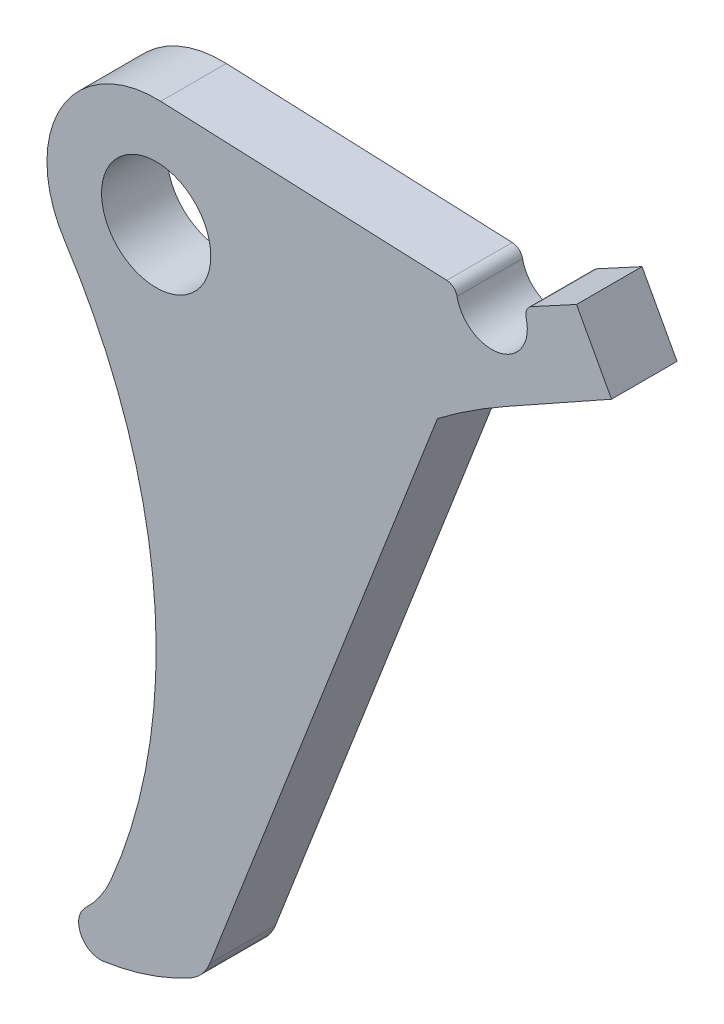
ISO-10303-21;
HEADER;
FILE_DESCRIPTION(('STEP AP214'),'2;1');
FILE_NAME('part.step','',(''),(''),'','','');
FILE_SCHEMA(('AUTOMOTIVE_DESIGN { 1 0 10303 214 1 1 1 1 }'));
ENDSEC;
DATA;
#1=APPLICATION_CONTEXT('core data for automotive mechanical design processes');
#2=APPLICATION_PROTOCOL_DEFINITION('international standard','automotive_design',2000,#1);
#3=PRODUCT_CONTEXT('',#1,'mechanical');
#4=PRODUCT('Part','Part','',(#3));
#5=PRODUCT_RELATED_PRODUCT_CATEGORY('part','',(#4));
#6=PRODUCT_DEFINITION_FORMATION('','',#4);
#7=PRODUCT_DEFINITION_CONTEXT('part definition',#1,'design');
#8=PRODUCT_DEFINITION('design','',#6,#7);
#9=PRODUCT_DEFINITION_SHAPE('','',#8);
#10=(LENGTH_UNIT() NAMED_UNIT(*) SI_UNIT(.MILLI.,.METRE.));
#11=(NAMED_UNIT(*) PLANE_ANGLE_UNIT() SI_UNIT($,.RADIAN.));
#12=(NAMED_UNIT(*) SI_UNIT($,.STERADIAN.) SOLID_ANGLE_UNIT());
#13=UNCERTAINTY_MEASURE_WITH_UNIT(LENGTH_MEASURE(1.E-05),#10,'distance_accuracy_value','');
#14=(GEOMETRIC_REPRESENTATION_CONTEXT(3) GLOBAL_UNCERTAINTY_ASSIGNED_CONTEXT((#13)) GLOBAL_UNIT_ASSIGNED_CONTEXT((#10,
#11,#12)) REPRESENTATION_CONTEXT('',''));
#15=CARTESIAN_POINT('',(0.,0.,0.));
#16=DIRECTION('',(0.,0.,1.));
#17=DIRECTION('',(1.,0.,0.));
#18=AXIS2_PLACEMENT_3D('',#15,#16,#17);
#19=CARTESIAN_POINT('',(-5.09997800634963,-58.8502306487025,3.));
#20=DIRECTION('',(0.,0.,1.));
#21=DIRECTION('',(1.,0.,0.));
#22=AXIS2_PLACEMENT_3D('',#19,#20,#21);
#23=PLANE('',#22);
#24=CARTESIAN_POINT('',(-5.09997800634963,-58.8502306487025,3.));
#25=DIRECTION('',(0.,0.,1.));
#26=DIRECTION('',(1.,0.,0.));
#27=AXIS2_PLACEMENT_3D('',#24,#25,#26);
#28=CIRCLE('',#27,2.);
#29=CARTESIAN_POINT('',(-6.47627281252223,-57.399088820175,3.));
#30=VERTEX_POINT('',#29);
#31=CARTESIAN_POINT('',(-4.80610983765041,-60.8285232204485,3.));
#32=VERTEX_POINT('',#31);
#33=EDGE_CURVE('E215',#30,#32,#28,.T.);
#34=ORIENTED_EDGE('',*,*,#33,.T.);
#35=CARTESIAN_POINT('',(-8.31922159690976,-37.1785888712499,3.));
#36=DIRECTION('',(0.,0.,1.));
#37=DIRECTION('',(1.,0.,0.));
#38=AXIS2_PLACEMENT_3D('',#35,#36,#37);
#39=CIRCLE('',#38,23.9094405822146);
#40=CARTESIAN_POINT('',(3.09796295264736,-58.1859505788943,3.));
#41=VERTEX_POINT('',#40);
#42=EDGE_CURVE('E128',#32,#41,#39,.T.);
#43=ORIENTED_EDGE('',*,*,#42,.T.);
#44=CARTESIAN_POINT('',(1.18789157137882,-54.6714623773977,3.));
#45=DIRECTION('',(0.,0.,1.));
#46=DIRECTION('',(1.,0.,0.));
#47=AXIS2_PLACEMENT_3D('',#44,#45,#46);
#48=CIRCLE('',#47,4.00000000000001);
#49=CARTESIAN_POINT('',(4.91623441296361,-56.1204136034932,3.));
#50=VERTEX_POINT('',#49);
#51=EDGE_CURVE('E251',#41,#50,#48,.T.);
#52=ORIENTED_EDGE('',*,*,#51,.T.);
#53=DIRECTION('',(0.362237806523864,0.932085710396195,0.));
#54=VECTOR('',#53,1.);
#55=CARTESIAN_POINT('',(4.91623441296361,-56.1204136034932,3.));
#56=LINE('',#55,#54);
#57=CARTESIAN_POINT('',(25.7600480741137,-2.48652858702379,3.));
#58=VERTEX_POINT('',#57);
#59=EDGE_CURVE('E270',#50,#58,#56,.T.);
#60=ORIENTED_EDGE('',*,*,#59,.T.);
#61=CARTESIAN_POINT('',(58.6903833292251,-46.1515151172352,3.));
#62=DIRECTION('',(0.,0.,-1.));
#63=DIRECTION('',(1.,0.,0.));
#64=AXIS2_PLACEMENT_3D('',#61,#62,#63);
#65=CIRCLE('',#64,54.6903833292251);
#66=CARTESIAN_POINT('',(31.9920212548681,1.57935006708883,3.));
#67=VERTEX_POINT('',#66);
#68=EDGE_CURVE('E267',#58,#67,#65,.T.);
#69=ORIENTED_EDGE('',*,*,#68,.T.);
#70=DIRECTION('',(0.872746948892164,0.488172882490843,0.));
#71=VECTOR('',#70,1.);
#72=CARTESIAN_POINT('',(31.9920212548681,1.57935006708883,3.));
#73=LINE('',#72,#71);
#74=CARTESIAN_POINT('',(41.6932201112617,7.00573650745857,3.));
#75=VERTEX_POINT('',#74);
#76=EDGE_CURVE('E269',#67,#75,#73,.T.);
#77=ORIENTED_EDGE('',*,*,#76,.T.);
#78=DIRECTION('',(-0.476238263001309,0.879316278055568,0.));
#79=VECTOR('',#78,1.);
#80=CARTESIAN_POINT('',(41.6932201112617,7.00573650745857,3.));
#81=LINE('',#80,#79);
#82=CARTESIAN_POINT('',(38.4898873605694,12.9203024937377,3.));
#83=VERTEX_POINT('',#82);
#84=EDGE_CURVE('E272',#75,#83,#81,.T.);
#85=ORIENTED_EDGE('',*,*,#84,.T.);
#86=DIRECTION('',(-0.879316278055567,-0.47623826300131,0.));
#87=VECTOR('',#86,1.);
#88=CARTESIAN_POINT('',(38.4898873605694,12.9203024937377,3.));
#89=LINE('',#88,#87);
#90=CARTESIAN_POINT('',(34.365244292859,10.6863931495249,3.));
#91=VERTEX_POINT('',#90);
#92=EDGE_CURVE('E278',#83,#91,#89,.T.);
#93=ORIENTED_EDGE('',*,*,#92,.T.);
#94=CARTESIAN_POINT('',(34.8414825558603,9.8070768714693,3.));
#95=DIRECTION('',(0.,0.,1.));
#96=DIRECTION('',(1.,0.,0.));
#97=AXIS2_PLACEMENT_3D('',#94,#95,#96);
#98=CIRCLE('',#97,1.);
#99=CARTESIAN_POINT('',(33.8747977113715,9.55110731969473,3.));
#100=VERTEX_POINT('',#99);
#101=EDGE_CURVE('E280',#91,#100,#98,.T.);
#102=ORIENTED_EDGE('',*,*,#101,.T.);
#103=CARTESIAN_POINT('',(30.7330719667829,8.71920627642735,3.));
#104=DIRECTION('',(0.,0.,-1.));
#105=DIRECTION('',(1.,0.,0.));
#106=AXIS2_PLACEMENT_3D('',#103,#104,#105);
#107=CIRCLE('',#106,3.25);
#108=CARTESIAN_POINT('',(27.5450357775952,8.08760097528636,3.));
#109=VERTEX_POINT('',#108);
#110=EDGE_CURVE('E282',#100,#109,#107,.T.);
#111=ORIENTED_EDGE('',*,*,#110,.T.);
#112=CARTESIAN_POINT('',(26.5641015655374,7.8932608826276,3.));
#113=DIRECTION('',(0.,0.,1.));
#114=DIRECTION('',(1.,0.,0.));
#115=AXIS2_PLACEMENT_3D('',#112,#113,#114);
#116=CIRCLE('',#115,0.999999999999997);
#117=CARTESIAN_POINT('',(26.6060257735832,8.89238167651576,3.));
#118=VERTEX_POINT('',#117);
#119=EDGE_CURVE('E284',#109,#118,#116,.T.);
#120=ORIENTED_EDGE('',*,*,#119,.T.);
#121=DIRECTION('',(-0.999120793888174,0.0419242080457737,0.));
#122=VECTOR('',#121,1.);
#123=CARTESIAN_POINT('',(0.419242080457741,9.99120793888174,3.));
#124=LINE('',#123,#122);
#125=CARTESIAN_POINT('',(0.419242080457741,9.99120793888173,3.));
#126=VERTEX_POINT('',#125);
#127=EDGE_CURVE('E168',#118,#126,#124,.T.);
#128=ORIENTED_EDGE('',*,*,#127,.T.);
#129=CARTESIAN_POINT('',(0.,0.,3.));
#130=DIRECTION('',(0.,0.,1.));
#131=DIRECTION('',(1.,0.,0.));
#132=AXIS2_PLACEMENT_3D('',#129,#130,#131);
#133=CIRCLE('',#132,9.99999999999999);
#134=CARTESIAN_POINT('',(-8.38314883928712,-5.45186349227113,3.));
#135=VERTEX_POINT('',#134);
#136=EDGE_CURVE('E162',#126,#135,#133,.T.);
#137=ORIENTED_EDGE('',*,*,#136,.T.);
#138=CARTESIAN_POINT('',(-51.84861193773,-33.7190189470957,3.));
#139=DIRECTION('',(0.,0.,-1.));
#140=DIRECTION('',(1.,0.,0.));
#141=AXIS2_PLACEMENT_3D('',#138,#139,#140);
#142=CIRCLE('',#141,51.84861193773);
#143=CARTESIAN_POINT('',(-4.16010245039586,-54.0680882807473,3.));
#144=VERTEX_POINT('',#143);
#145=EDGE_CURVE('E166',#135,#144,#142,.T.);
#146=ORIENTED_EDGE('',*,*,#145,.T.);
#147=CARTESIAN_POINT('',(-13.3577468433852,-50.1433796775371,3.));
#148=DIRECTION('',(0.,0.,-1.));
#149=DIRECTION('',(1.,0.,0.));
#150=AXIS2_PLACEMENT_3D('',#147,#148,#149);
#151=CIRCLE('',#150,10.);
#152=EDGE_CURVE('E64',#144,#30,#151,.T.);
#153=ORIENTED_EDGE('',*,*,#152,.T.);
#154=EDGE_LOOP('',(#34,#43,#52,#60,#69,#77,#85,#93,#102,#111,#120,#128,#137,#146,#153));
#155=FACE_BOUND('',#154,.T.);
#156=CARTESIAN_POINT('',(0.,0.,3.));
#157=DIRECTION('',(0.,0.,1.));
#158=DIRECTION('',(1.,0.,0.));
#159=AXIS2_PLACEMENT_3D('',#156,#157,#158);
#160=CIRCLE('',#159,5.);
#161=CARTESIAN_POINT('',(5.,0.,3.));
#162=VERTEX_POINT('',#161);
#163=EDGE_CURVE('E190',#162,#162,#160,.T.);
#164=ORIENTED_EDGE('',*,*,#163,.F.);
#165=EDGE_LOOP('',(#164));
#166=FACE_BOUND('',#165,.T.);
#167=ADVANCED_FACE('F47',(#155,#166),#23,.T.);
#168=CARTESIAN_POINT('',(-5.09997800634963,-58.8502306487025,-3.));
#169=DIRECTION('',(0.,0.,1.));
#170=DIRECTION('',(1.,0.,0.));
#171=AXIS2_PLACEMENT_3D('',#168,#169,#170);
#172=PLANE('',#171);
#173=CARTESIAN_POINT('',(-5.09997800634963,-58.8502306487025,-3.));
#174=DIRECTION('',(0.,0.,1.));
#175=DIRECTION('',(1.,0.,0.));
#176=AXIS2_PLACEMENT_3D('',#173,#174,#175);
#177=CIRCLE('',#176,2.);
#178=CARTESIAN_POINT('',(-6.47627281252223,-57.399088820175,-3.));
#179=VERTEX_POINT('',#178);
#180=CARTESIAN_POINT('',(-4.80610983765041,-60.8285232204485,-3.));
#181=VERTEX_POINT('',#180);
#182=EDGE_CURVE('E186',#179,#181,#177,.T.);
#183=ORIENTED_EDGE('',*,*,#182,.F.);
#184=CARTESIAN_POINT('',(-13.3577468433852,-50.1433796775371,-3.));
#185=DIRECTION('',(0.,0.,-1.));
#186=DIRECTION('',(1.,0.,0.));
#187=AXIS2_PLACEMENT_3D('',#184,#185,#186);
#188=CIRCLE('',#187,10.);
#189=CARTESIAN_POINT('',(-4.16010245039586,-54.0680882807473,-3.));
#190=VERTEX_POINT('',#189);
#191=EDGE_CURVE('E120',#190,#179,#188,.T.);
#192=ORIENTED_EDGE('',*,*,#191,.F.);
#193=CARTESIAN_POINT('',(-51.84861193773,-33.7190189470957,-3.));
#194=DIRECTION('',(0.,0.,-1.));
#195=DIRECTION('',(1.,0.,0.));
#196=AXIS2_PLACEMENT_3D('',#193,#194,#195);
#197=CIRCLE('',#196,51.84861193773);
#198=CARTESIAN_POINT('',(-8.38314883928712,-5.45186349227113,-3.));
#199=VERTEX_POINT('',#198);
#200=EDGE_CURVE('E114',#199,#190,#197,.T.);
#201=ORIENTED_EDGE('',*,*,#200,.F.);
#202=CARTESIAN_POINT('',(0.,0.,-3.));
#203=DIRECTION('',(0.,0.,1.));
#204=DIRECTION('',(1.,0.,0.));
#205=AXIS2_PLACEMENT_3D('',#202,#203,#204);
#206=CIRCLE('',#205,9.99999999999999);
#207=CARTESIAN_POINT('',(0.419242080457741,9.99120793888173,-3.));
#208=VERTEX_POINT('',#207);
#209=EDGE_CURVE('E176',#208,#199,#206,.T.);
#210=ORIENTED_EDGE('',*,*,#209,.F.);
#211=DIRECTION('',(-0.999120793888174,0.0419242080457737,0.));
#212=VECTOR('',#211,1.);
#213=CARTESIAN_POINT('',(0.419242080457741,9.99120793888174,-3.));
#214=LINE('',#213,#212);
#215=CARTESIAN_POINT('',(26.6060257735832,8.89238167651576,-3.));
#216=VERTEX_POINT('',#215);
#217=EDGE_CURVE('E210',#216,#208,#214,.T.);
#218=ORIENTED_EDGE('',*,*,#217,.F.);
#219=CARTESIAN_POINT('',(26.5641015655374,7.8932608826276,-3.));
#220=DIRECTION('',(0.,0.,1.));
#221=DIRECTION('',(1.,0.,0.));
#222=AXIS2_PLACEMENT_3D('',#219,#220,#221);
#223=CIRCLE('',#222,0.999999999999997);
#224=CARTESIAN_POINT('',(27.5450357775952,8.08760097528636,-3.));
#225=VERTEX_POINT('',#224);
#226=EDGE_CURVE('E208',#225,#216,#223,.T.);
#227=ORIENTED_EDGE('',*,*,#226,.F.);
#228=CARTESIAN_POINT('',(30.7330719667829,8.71920627642735,-3.));
#229=DIRECTION('',(0.,0.,-1.));
#230=DIRECTION('',(1.,0.,0.));
#231=AXIS2_PLACEMENT_3D('',#228,#229,#230);
#232=CIRCLE('',#231,3.25);
#233=CARTESIAN_POINT('',(33.8747977113715,9.55110731969473,-3.));
#234=VERTEX_POINT('',#233);
#235=EDGE_CURVE('E206',#234,#225,#232,.T.);
#236=ORIENTED_EDGE('',*,*,#235,.F.);
#237=CARTESIAN_POINT('',(34.8414825558603,9.8070768714693,-3.));
#238=DIRECTION('',(0.,0.,1.));
#239=DIRECTION('',(1.,0.,0.));
#240=AXIS2_PLACEMENT_3D('',#237,#238,#239);
#241=CIRCLE('',#240,1.);
#242=CARTESIAN_POINT('',(34.365244292859,10.6863931495249,-3.));
#243=VERTEX_POINT('',#242);
#244=EDGE_CURVE('E204',#243,#234,#241,.T.);
#245=ORIENTED_EDGE('',*,*,#244,.F.);
#246=DIRECTION('',(-0.879316278055567,-0.47623826300131,0.));
#247=VECTOR('',#246,1.);
#248=CARTESIAN_POINT('',(38.4898873605694,12.9203024937377,-3.));
#249=LINE('',#248,#247);
#250=CARTESIAN_POINT('',(38.4898873605694,12.9203024937377,-3.));
#251=VERTEX_POINT('',#250);
#252=EDGE_CURVE('E202',#251,#243,#249,.T.);
#253=ORIENTED_EDGE('',*,*,#252,.F.);
#254=DIRECTION('',(-0.476238263001309,0.879316278055568,0.));
#255=VECTOR('',#254,1.);
#256=CARTESIAN_POINT('',(41.6932201112617,7.00573650745857,-3.));
#257=LINE('',#256,#255);
#258=CARTESIAN_POINT('',(41.6932201112617,7.00573650745857,-3.));
#259=VERTEX_POINT('',#258);
#260=EDGE_CURVE('E200',#259,#251,#257,.T.);
#261=ORIENTED_EDGE('',*,*,#260,.F.);
#262=DIRECTION('',(0.872746948892164,0.488172882490843,0.));
#263=VECTOR('',#262,1.);
#264=CARTESIAN_POINT('',(31.9920212548681,1.57935006708883,-3.));
#265=LINE('',#264,#263);
#266=CARTESIAN_POINT('',(31.9920212548681,1.57935006708883,-3.));
#267=VERTEX_POINT('',#266);
#268=EDGE_CURVE('E198',#267,#259,#265,.T.);
#269=ORIENTED_EDGE('',*,*,#268,.F.);
#270=CARTESIAN_POINT('',(58.6903833292251,-46.1515151172352,-3.));
#271=DIRECTION('',(0.,0.,-1.));
#272=DIRECTION('',(1.,0.,0.));
#273=AXIS2_PLACEMENT_3D('',#270,#271,#272);
#274=CIRCLE('',#273,54.6903833292251);
#275=CARTESIAN_POINT('',(25.7600480741137,-2.48652858702379,-3.));
#276=VERTEX_POINT('',#275);
#277=EDGE_CURVE('E196',#276,#267,#274,.T.);
#278=ORIENTED_EDGE('',*,*,#277,.F.);
#279=DIRECTION('',(0.362237806523864,0.932085710396195,0.));
#280=VECTOR('',#279,1.);
#281=CARTESIAN_POINT('',(4.91623441296361,-56.1204136034932,-3.));
#282=LINE('',#281,#280);
#283=CARTESIAN_POINT('',(4.91623441296361,-56.1204136034932,-3.));
#284=VERTEX_POINT('',#283);
#285=EDGE_CURVE('E194',#284,#276,#282,.T.);
#286=ORIENTED_EDGE('',*,*,#285,.F.);
#287=CARTESIAN_POINT('',(1.18789157137882,-54.6714623773977,-3.));
#288=DIRECTION('',(0.,0.,1.));
#289=DIRECTION('',(1.,0.,0.));
#290=AXIS2_PLACEMENT_3D('',#287,#288,#289);
#291=CIRCLE('',#290,4.00000000000001);
#292=CARTESIAN_POINT('',(3.09796295264736,-58.1859505788943,-3.));
#293=VERTEX_POINT('',#292);
#294=EDGE_CURVE('E192',#293,#284,#291,.T.);
#295=ORIENTED_EDGE('',*,*,#294,.F.);
#296=CARTESIAN_POINT('',(-8.31922159690976,-37.1785888712499,-3.));
#297=DIRECTION('',(0.,0.,1.));
#298=DIRECTION('',(1.,0.,0.));
#299=AXIS2_PLACEMENT_3D('',#296,#297,#298);
#300=CIRCLE('',#299,23.9094405822146);
#301=EDGE_CURVE('E189',#181,#293,#300,.T.);
#302=ORIENTED_EDGE('',*,*,#301,.F.);
#303=EDGE_LOOP('',(#183,#192,#201,#210,#218,#227,#236,#245,#253,#261,#269,#278,#286,#295,#302));
#304=FACE_BOUND('',#303,.T.);
#305=CARTESIAN_POINT('',(0.,0.,-3.));
#306=DIRECTION('',(0.,0.,1.));
#307=DIRECTION('',(1.,0.,0.));
#308=AXIS2_PLACEMENT_3D('',#305,#306,#307);
#309=CIRCLE('',#308,5.);
#310=CARTESIAN_POINT('',(5.,0.,-3.));
#311=VERTEX_POINT('',#310);
#312=EDGE_CURVE('E470',#311,#311,#309,.T.);
#313=ORIENTED_EDGE('',*,*,#312,.T.);
#314=EDGE_LOOP('',(#313));
#315=FACE_BOUND('',#314,.T.);
#316=ADVANCED_FACE('F255',(#304,#315),#172,.F.);
#317=CARTESIAN_POINT('',(-5.09997800634963,-58.8502306487025,3.));
#318=DIRECTION('',(0.,0.,-1.));
#319=DIRECTION('',(-1.,0.,0.));
#320=AXIS2_PLACEMENT_3D('',#317,#318,#319);
#321=CYLINDRICAL_SURFACE('',#320,2.);
#322=ORIENTED_EDGE('',*,*,#182,.T.);
#323=DIRECTION('',(0.,0.,-1.));
#324=VECTOR('',#323,1.);
#325=CARTESIAN_POINT('',(-4.80610983765041,-60.8285232204485,3.));
#326=LINE('',#325,#324);
#327=EDGE_CURVE('E13',#32,#181,#326,.T.);
#328=ORIENTED_EDGE('',*,*,#327,.F.);
#329=ORIENTED_EDGE('',*,*,#33,.F.);
#330=DIRECTION('',(0.,0.,-1.));
#331=VECTOR('',#330,1.);
#332=CARTESIAN_POINT('',(-6.47627281252223,-57.399088820175,3.));
#333=LINE('',#332,#331);
#334=EDGE_CURVE('E182',#30,#179,#333,.T.);
#335=ORIENTED_EDGE('',*,*,#334,.T.);
#336=EDGE_LOOP('',(#322,#328,#329,#335));
#337=FACE_BOUND('',#336,.T.);
#338=ADVANCED_FACE('F49',(#337),#321,.T.);
#339=CARTESIAN_POINT('',(-8.31922159690976,-37.1785888712499,3.));
#340=DIRECTION('',(0.,0.,-1.));
#341=DIRECTION('',(-1.,0.,0.));
#342=AXIS2_PLACEMENT_3D('',#339,#340,#341);
#343=CYLINDRICAL_SURFACE('',#342,23.9094405822146);
#344=ORIENTED_EDGE('',*,*,#301,.T.);
#345=DIRECTION('',(0.,0.,-1.));
#346=VECTOR('',#345,1.);
#347=CARTESIAN_POINT('',(3.09796295264736,-58.1859505788943,3.));
#348=LINE('',#347,#346);
#349=EDGE_CURVE('E56',#41,#293,#348,.T.);
#350=ORIENTED_EDGE('',*,*,#349,.F.);
#351=ORIENTED_EDGE('',*,*,#42,.F.);
#352=ORIENTED_EDGE('',*,*,#327,.T.);
#353=EDGE_LOOP('',(#344,#350,#351,#352));
#354=FACE_BOUND('',#353,.T.);
#355=ADVANCED_FACE('F318',(#354),#343,.T.);
#356=CARTESIAN_POINT('',(1.18789157137882,-54.6714623773977,3.));
#357=DIRECTION('',(0.,0.,-1.));
#358=DIRECTION('',(-1.,0.,0.));
#359=AXIS2_PLACEMENT_3D('',#356,#357,#358);
#360=CYLINDRICAL_SURFACE('',#359,4.00000000000001);
#361=ORIENTED_EDGE('',*,*,#294,.T.);
#362=DIRECTION('',(0.,0.,-1.));
#363=VECTOR('',#362,1.);
#364=CARTESIAN_POINT('',(4.91623441296361,-56.1204136034932,3.));
#365=LINE('',#364,#363);
#366=EDGE_CURVE('E243',#50,#284,#365,.T.);
#367=ORIENTED_EDGE('',*,*,#366,.F.);
#368=ORIENTED_EDGE('',*,*,#51,.F.);
#369=ORIENTED_EDGE('',*,*,#349,.T.);
#370=EDGE_LOOP('',(#361,#367,#368,#369));
#371=FACE_BOUND('',#370,.T.);
#372=ADVANCED_FACE('F249',(#371),#360,.T.);
#373=CARTESIAN_POINT('',(4.91623441296361,-56.1204136034932,3.));
#374=DIRECTION('',(-0.932085710396195,0.362237806523864,0.));
#375=DIRECTION('',(-0.362237806523864,-0.932085710396195,0.));
#376=AXIS2_PLACEMENT_3D('',#373,#374,#375);
#377=PLANE('',#376);
#378=ORIENTED_EDGE('',*,*,#285,.T.);
#379=DIRECTION('',(0.,0.,-1.));
#380=VECTOR('',#379,1.);
#381=CARTESIAN_POINT('',(25.7600480741137,-2.48652858702379,3.));
#382=LINE('',#381,#380);
#383=EDGE_CURVE('E240',#58,#276,#382,.T.);
#384=ORIENTED_EDGE('',*,*,#383,.F.);
#385=ORIENTED_EDGE('',*,*,#59,.F.);
#386=ORIENTED_EDGE('',*,*,#366,.T.);
#387=EDGE_LOOP('',(#378,#384,#385,#386));
#388=FACE_BOUND('',#387,.T.);
#389=ADVANCED_FACE('F261',(#388),#377,.F.);
#390=CARTESIAN_POINT('',(58.6903833292251,-46.1515151172352,3.));
#391=DIRECTION('',(0.,0.,-1.));
#392=DIRECTION('',(-1.,0.,0.));
#393=AXIS2_PLACEMENT_3D('',#390,#391,#392);
#394=CYLINDRICAL_SURFACE('',#393,54.6903833292251);
#395=ORIENTED_EDGE('',*,*,#277,.T.);
#396=DIRECTION('',(0.,0.,-1.));
#397=VECTOR('',#396,1.);
#398=CARTESIAN_POINT('',(31.9920212548681,1.57935006708883,3.));
#399=LINE('',#398,#397);
#400=EDGE_CURVE('E237',#67,#267,#399,.T.);
#401=ORIENTED_EDGE('',*,*,#400,.F.);
#402=ORIENTED_EDGE('',*,*,#68,.F.);
#403=ORIENTED_EDGE('',*,*,#383,.T.);
#404=EDGE_LOOP('',(#395,#401,#402,#403));
#405=FACE_BOUND('',#404,.T.);
#406=ADVANCED_FACE('F265',(#405),#394,.F.);
#407=CARTESIAN_POINT('',(31.9920212548681,1.57935006708883,3.));
#408=DIRECTION('',(-0.488172882490843,0.872746948892164,0.));
#409=DIRECTION('',(-0.872746948892164,-0.488172882490843,0.));
#410=AXIS2_PLACEMENT_3D('',#407,#408,#409);
#411=PLANE('',#410);
#412=ORIENTED_EDGE('',*,*,#268,.T.);
#413=DIRECTION('',(0.,0.,-1.));
#414=VECTOR('',#413,1.);
#415=CARTESIAN_POINT('',(41.6932201112617,7.00573650745857,3.));
#416=LINE('',#415,#414);
#417=EDGE_CURVE('E234',#75,#259,#416,.T.);
#418=ORIENTED_EDGE('',*,*,#417,.F.);
#419=ORIENTED_EDGE('',*,*,#76,.F.);
#420=ORIENTED_EDGE('',*,*,#400,.T.);
#421=EDGE_LOOP('',(#412,#418,#419,#420));
#422=FACE_BOUND('',#421,.T.);
#423=ADVANCED_FACE('F331',(#422),#411,.F.);
#424=CARTESIAN_POINT('',(41.6932201112617,7.00573650745857,3.));
#425=DIRECTION('',(-0.879316278055567,-0.476238263001309,0.));
#426=DIRECTION('',(0.476238263001309,-0.879316278055568,0.));
#427=AXIS2_PLACEMENT_3D('',#424,#425,#426);
#428=PLANE('',#427);
#429=ORIENTED_EDGE('',*,*,#260,.T.);
#430=DIRECTION('',(0.,0.,-1.));
#431=VECTOR('',#430,1.);
#432=CARTESIAN_POINT('',(38.4898873605694,12.9203024937377,3.));
#433=LINE('',#432,#431);
#434=EDGE_CURVE('E231',#83,#251,#433,.T.);
#435=ORIENTED_EDGE('',*,*,#434,.F.);
#436=ORIENTED_EDGE('',*,*,#84,.F.);
#437=ORIENTED_EDGE('',*,*,#417,.T.);
#438=EDGE_LOOP('',(#429,#435,#436,#437));
#439=FACE_BOUND('',#438,.T.);
#440=ADVANCED_FACE('F334',(#439),#428,.F.);
#441=CARTESIAN_POINT('',(38.4898873605694,12.9203024937377,3.));
#442=DIRECTION('',(0.47623826300131,-0.879316278055567,0.));
#443=DIRECTION('',(0.879316278055567,0.47623826300131,0.));
#444=AXIS2_PLACEMENT_3D('',#441,#442,#443);
#445=PLANE('',#444);
#446=ORIENTED_EDGE('',*,*,#252,.T.);
#447=DIRECTION('',(0.,0.,-1.));
#448=VECTOR('',#447,1.);
#449=CARTESIAN_POINT('',(34.365244292859,10.6863931495249,3.));
#450=LINE('',#449,#448);
#451=EDGE_CURVE('E228',#91,#243,#450,.T.);
#452=ORIENTED_EDGE('',*,*,#451,.F.);
#453=ORIENTED_EDGE('',*,*,#92,.F.);
#454=ORIENTED_EDGE('',*,*,#434,.T.);
#455=EDGE_LOOP('',(#446,#452,#453,#454));
#456=FACE_BOUND('',#455,.T.);
#457=ADVANCED_FACE('F338',(#456),#445,.F.);
#458=CARTESIAN_POINT('',(34.8414825558603,9.8070768714693,3.));
#459=DIRECTION('',(0.,0.,-1.));
#460=DIRECTION('',(-1.,0.,0.));
#461=AXIS2_PLACEMENT_3D('',#458,#459,#460);
#462=CYLINDRICAL_SURFACE('',#461,1.);
#463=ORIENTED_EDGE('',*,*,#244,.T.);
#464=DIRECTION('',(0.,0.,-1.));
#465=VECTOR('',#464,1.);
#466=CARTESIAN_POINT('',(33.8747977113715,9.55110731969473,3.));
#467=LINE('',#466,#465);
#468=EDGE_CURVE('E225',#100,#234,#467,.T.);
#469=ORIENTED_EDGE('',*,*,#468,.F.);
#470=ORIENTED_EDGE('',*,*,#101,.F.);
#471=ORIENTED_EDGE('',*,*,#451,.T.);
#472=EDGE_LOOP('',(#463,#469,#470,#471));
#473=FACE_BOUND('',#472,.T.);
#474=ADVANCED_FACE('F342',(#473),#462,.T.);
#475=CARTESIAN_POINT('',(30.7330719667829,8.71920627642735,3.));
#476=DIRECTION('',(0.,0.,-1.));
#477=DIRECTION('',(-1.,0.,0.));
#478=AXIS2_PLACEMENT_3D('',#475,#476,#477);
#479=CYLINDRICAL_SURFACE('',#478,3.25);
#480=ORIENTED_EDGE('',*,*,#235,.T.);
#481=DIRECTION('',(0.,0.,-1.));
#482=VECTOR('',#481,1.);
#483=CARTESIAN_POINT('',(27.5450357775952,8.08760097528636,3.));
#484=LINE('',#483,#482);
#485=EDGE_CURVE('E222',#109,#225,#484,.T.);
#486=ORIENTED_EDGE('',*,*,#485,.F.);
#487=ORIENTED_EDGE('',*,*,#110,.F.);
#488=ORIENTED_EDGE('',*,*,#468,.T.);
#489=EDGE_LOOP('',(#480,#486,#487,#488));
#490=FACE_BOUND('',#489,.T.);
#491=ADVANCED_FACE('F346',(#490),#479,.F.);
#492=CARTESIAN_POINT('',(26.5641015655374,7.8932608826276,3.));
#493=DIRECTION('',(0.,0.,-1.));
#494=DIRECTION('',(-1.,0.,0.));
#495=AXIS2_PLACEMENT_3D('',#492,#493,#494);
#496=CYLINDRICAL_SURFACE('',#495,0.999999999999997);
#497=ORIENTED_EDGE('',*,*,#226,.T.);
#498=DIRECTION('',(0.,0.,-1.));
#499=VECTOR('',#498,1.);
#500=CARTESIAN_POINT('',(26.6060257735832,8.89238167651576,3.));
#501=LINE('',#500,#499);
#502=EDGE_CURVE('E219',#118,#216,#501,.T.);
#503=ORIENTED_EDGE('',*,*,#502,.F.);
#504=ORIENTED_EDGE('',*,*,#119,.F.);
#505=ORIENTED_EDGE('',*,*,#485,.T.);
#506=EDGE_LOOP('',(#497,#503,#504,#505));
#507=FACE_BOUND('',#506,.T.);
#508=ADVANCED_FACE('F290',(#507),#496,.T.);
#509=CARTESIAN_POINT('',(0.419242080457741,9.99120793888174,3.));
#510=DIRECTION('',(-0.0419242080457737,-0.999120793888174,0.));
#511=DIRECTION('',(0.999120793888174,-0.0419242080457737,0.));
#512=AXIS2_PLACEMENT_3D('',#509,#510,#511);
#513=PLANE('',#512);
#514=ORIENTED_EDGE('',*,*,#217,.T.);
#515=DIRECTION('',(0.,0.,-1.));
#516=VECTOR('',#515,1.);
#517=CARTESIAN_POINT('',(0.419242080457741,9.99120793888173,3.));
#518=LINE('',#517,#516);
#519=EDGE_CURVE('E177',#126,#208,#518,.T.);
#520=ORIENTED_EDGE('',*,*,#519,.F.);
#521=ORIENTED_EDGE('',*,*,#127,.F.);
#522=ORIENTED_EDGE('',*,*,#502,.T.);
#523=EDGE_LOOP('',(#514,#520,#521,#522));
#524=FACE_BOUND('',#523,.T.);
#525=ADVANCED_FACE('F294',(#524),#513,.F.);
#526=CARTESIAN_POINT('',(0.,0.,3.));
#527=DIRECTION('',(0.,0.,-1.));
#528=DIRECTION('',(-1.,0.,0.));
#529=AXIS2_PLACEMENT_3D('',#526,#527,#528);
#530=CYLINDRICAL_SURFACE('',#529,9.99999999999999);
#531=ORIENTED_EDGE('',*,*,#209,.T.);
#532=DIRECTION('',(0.,0.,-1.));
#533=VECTOR('',#532,1.);
#534=CARTESIAN_POINT('',(-8.38314883928712,-5.45186349227113,3.));
#535=LINE('',#534,#533);
#536=EDGE_CURVE('E173',#135,#199,#535,.T.);
#537=ORIENTED_EDGE('',*,*,#536,.F.);
#538=ORIENTED_EDGE('',*,*,#136,.F.);
#539=ORIENTED_EDGE('',*,*,#519,.T.);
#540=EDGE_LOOP('',(#531,#537,#538,#539));
#541=FACE_BOUND('',#540,.T.);
#542=ADVANCED_FACE('F174',(#541),#530,.T.);
#543=CARTESIAN_POINT('',(-51.84861193773,-33.7190189470957,3.));
#544=DIRECTION('',(0.,0.,-1.));
#545=DIRECTION('',(-1.,0.,0.));
#546=AXIS2_PLACEMENT_3D('',#543,#544,#545);
#547=CYLINDRICAL_SURFACE('',#546,51.84861193773);
#548=ORIENTED_EDGE('',*,*,#200,.T.);
#549=DIRECTION('',(0.,0.,-1.));
#550=VECTOR('',#549,1.);
#551=CARTESIAN_POINT('',(-4.16010245039586,-54.0680882807473,3.));
#552=LINE('',#551,#550);
#553=EDGE_CURVE('E178',#144,#190,#552,.T.);
#554=ORIENTED_EDGE('',*,*,#553,.F.);
#555=ORIENTED_EDGE('',*,*,#145,.F.);
#556=ORIENTED_EDGE('',*,*,#536,.T.);
#557=EDGE_LOOP('',(#548,#554,#555,#556));
#558=FACE_BOUND('',#557,.T.);
#559=ADVANCED_FACE('F180',(#558),#547,.F.);
#560=CARTESIAN_POINT('',(-13.3577468433852,-50.1433796775371,3.));
#561=DIRECTION('',(0.,0.,-1.));
#562=DIRECTION('',(-1.,0.,0.));
#563=AXIS2_PLACEMENT_3D('',#560,#561,#562);
#564=CYLINDRICAL_SURFACE('',#563,10.);
#565=ORIENTED_EDGE('',*,*,#191,.T.);
#566=ORIENTED_EDGE('',*,*,#334,.F.);
#567=ORIENTED_EDGE('',*,*,#152,.F.);
#568=ORIENTED_EDGE('',*,*,#553,.T.);
#569=EDGE_LOOP('',(#565,#566,#567,#568));
#570=FACE_BOUND('',#569,.T.);
#571=ADVANCED_FACE('F298',(#570),#564,.F.);
#572=CARTESIAN_POINT('',(0.,0.,3.));
#573=DIRECTION('',(0.,0.,-1.));
#574=DIRECTION('',(-1.,0.,0.));
#575=AXIS2_PLACEMENT_3D('',#572,#573,#574);
#576=CYLINDRICAL_SURFACE('',#575,5.);
#577=ORIENTED_EDGE('',*,*,#163,.T.);
#578=EDGE_LOOP('',(#577));
#579=FACE_BOUND('',#578,.T.);
#580=ORIENTED_EDGE('',*,*,#312,.F.);
#581=EDGE_LOOP('',(#580));
#582=FACE_BOUND('',#581,.T.);
#583=ADVANCED_FACE('F300',(#579,#582),#576,.F.);
#584=CLOSED_SHELL('',(#167,#316,#338,#355,#372,#389,#406,#423,#440,#457,#474,#491,#508,#525,
#542,#559,#571,#583));
#585=MANIFOLD_SOLID_BREP('B2',#584);
#586=ADVANCED_BREP_SHAPE_REPRESENTATION('',(#18,#585),#14);
#587=SHAPE_DEFINITION_REPRESENTATION(#9,#586);
ENDSEC;
END-ISO-10303-21;
